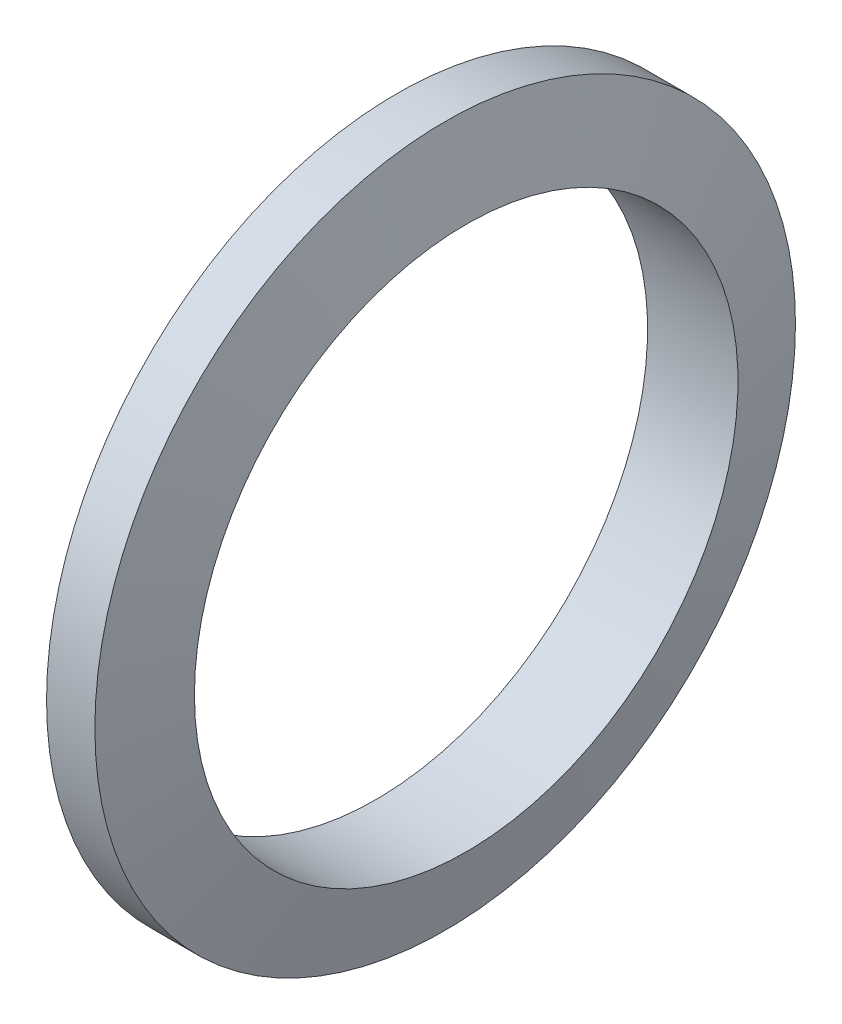
ISO-10303-21;
HEADER;
FILE_DESCRIPTION(('STEP AP214'),'2;1');
FILE_NAME('part.step','',(''),(''),'','','');
FILE_SCHEMA(('AUTOMOTIVE_DESIGN { 1 0 10303 214 1 1 1 1 }'));
ENDSEC;
DATA;
#1=APPLICATION_CONTEXT('core data for automotive mechanical design processes');
#2=APPLICATION_PROTOCOL_DEFINITION('international standard','automotive_design',2000,#1);
#3=PRODUCT_CONTEXT('',#1,'mechanical');
#4=PRODUCT('Part','Part','',(#3));
#5=PRODUCT_RELATED_PRODUCT_CATEGORY('part','',(#4));
#6=PRODUCT_DEFINITION_FORMATION('','',#4);
#7=PRODUCT_DEFINITION_CONTEXT('part definition',#1,'design');
#8=PRODUCT_DEFINITION('design','',#6,#7);
#9=PRODUCT_DEFINITION_SHAPE('','',#8);
#10=(LENGTH_UNIT() NAMED_UNIT(*) SI_UNIT(.MILLI.,.METRE.));
#11=(NAMED_UNIT(*) PLANE_ANGLE_UNIT() SI_UNIT($,.RADIAN.));
#12=(NAMED_UNIT(*) SI_UNIT($,.STERADIAN.) SOLID_ANGLE_UNIT());
#13=UNCERTAINTY_MEASURE_WITH_UNIT(LENGTH_MEASURE(1.E-05),#10,'distance_accuracy_value','');
#14=(GEOMETRIC_REPRESENTATION_CONTEXT(3) GLOBAL_UNCERTAINTY_ASSIGNED_CONTEXT((#13)) GLOBAL_UNIT_ASSIGNED_CONTEXT((#10,
#11,#12)) REPRESENTATION_CONTEXT('',''));
#15=CARTESIAN_POINT('',(0.,0.,0.));
#16=DIRECTION('',(0.,0.,1.));
#17=DIRECTION('',(1.,0.,0.));
#18=AXIS2_PLACEMENT_3D('',#15,#16,#17);
#19=CARTESIAN_POINT('',(-2.,0.,0.));
#20=DIRECTION('',(1.,0.,0.));
#21=DIRECTION('',(0.,0.,-1.));
#22=AXIS2_PLACEMENT_3D('',#19,#20,#21);
#23=CONICAL_SURFACE('',#22,29.,1.30899693899575);
#24=CARTESIAN_POINT('',(-3.74166975080231,0.,0.));
#25=DIRECTION('',(-1.,0.,0.));
#26=DIRECTION('',(0.,0.,1.));
#27=AXIS2_PLACEMENT_3D('',#24,#25,#26);
#28=CIRCLE('',#27,22.5);
#29=CARTESIAN_POINT('',(-3.74166975080231,0.,22.5));
#30=VERTEX_POINT('',#29);
#31=EDGE_CURVE('E10',#30,#30,#28,.T.);
#32=ORIENTED_EDGE('',*,*,#31,.F.);
#33=EDGE_LOOP('',(#32));
#34=FACE_BOUND('',#33,.T.);
#35=CARTESIAN_POINT('',(-2.,0.,0.));
#36=DIRECTION('',(-1.,0.,0.));
#37=DIRECTION('',(0.,0.,1.));
#38=AXIS2_PLACEMENT_3D('',#35,#36,#37);
#39=CIRCLE('',#38,29.);
#40=CARTESIAN_POINT('',(-2.,0.,29.));
#41=VERTEX_POINT('',#40);
#42=EDGE_CURVE('E44',#41,#41,#39,.T.);
#43=ORIENTED_EDGE('',*,*,#42,.T.);
#44=EDGE_LOOP('',(#43));
#45=FACE_BOUND('',#44,.T.);
#46=ADVANCED_FACE('F30',(#34,#45),#23,.T.);
#47=CARTESIAN_POINT('',(-10.,0.,0.));
#48=DIRECTION('',(-1.,0.,0.));
#49=DIRECTION('',(0.,0.,1.));
#50=AXIS2_PLACEMENT_3D('',#47,#48,#49);
#51=CYLINDRICAL_SURFACE('',#50,22.5);
#52=CARTESIAN_POINT('',(3.74166975080231,0.,0.));
#53=DIRECTION('',(-1.,0.,0.));
#54=DIRECTION('',(0.,0.,1.));
#55=AXIS2_PLACEMENT_3D('',#52,#53,#54);
#56=CIRCLE('',#55,22.5);
#57=CARTESIAN_POINT('',(3.74166975080231,0.,22.5));
#58=VERTEX_POINT('',#57);
#59=EDGE_CURVE('E36',#58,#58,#56,.T.);
#60=ORIENTED_EDGE('',*,*,#59,.F.);
#61=EDGE_LOOP('',(#60));
#62=FACE_BOUND('',#61,.T.);
#63=ORIENTED_EDGE('',*,*,#31,.T.);
#64=EDGE_LOOP('',(#63));
#65=FACE_BOUND('',#64,.T.);
#66=ADVANCED_FACE('F59',(#62,#65),#51,.F.);
#67=CARTESIAN_POINT('',(3.74166975080231,0.,0.));
#68=DIRECTION('',(-1.,0.,0.));
#69=DIRECTION('',(0.,0.,1.));
#70=AXIS2_PLACEMENT_3D('',#67,#68,#69);
#71=CONICAL_SURFACE('',#70,22.5,1.30899693899575);
#72=CARTESIAN_POINT('',(2.,0.,0.));
#73=DIRECTION('',(-1.,0.,0.));
#74=DIRECTION('',(0.,0.,1.));
#75=AXIS2_PLACEMENT_3D('',#72,#73,#74);
#76=CIRCLE('',#75,29.);
#77=CARTESIAN_POINT('',(2.,0.,29.));
#78=VERTEX_POINT('',#77);
#79=EDGE_CURVE('E40',#78,#78,#76,.T.);
#80=ORIENTED_EDGE('',*,*,#79,.F.);
#81=EDGE_LOOP('',(#80));
#82=FACE_BOUND('',#81,.T.);
#83=ORIENTED_EDGE('',*,*,#59,.T.);
#84=EDGE_LOOP('',(#83));
#85=FACE_BOUND('',#84,.T.);
#86=ADVANCED_FACE('F54',(#82,#85),#71,.T.);
#87=CARTESIAN_POINT('',(-10.,0.,0.));
#88=DIRECTION('',(-1.,0.,0.));
#89=DIRECTION('',(0.,0.,1.));
#90=AXIS2_PLACEMENT_3D('',#87,#88,#89);
#91=CYLINDRICAL_SURFACE('',#90,29.);
#92=ORIENTED_EDGE('',*,*,#42,.F.);
#93=EDGE_LOOP('',(#92));
#94=FACE_BOUND('',#93,.T.);
#95=ORIENTED_EDGE('',*,*,#79,.T.);
#96=EDGE_LOOP('',(#95));
#97=FACE_BOUND('',#96,.T.);
#98=ADVANCED_FACE('F51',(#94,#97),#91,.T.);
#99=CLOSED_SHELL('',(#46,#66,#86,#98));
#100=MANIFOLD_SOLID_BREP('B2',#99);
#101=ADVANCED_BREP_SHAPE_REPRESENTATION('',(#18,#100),#14);
#102=SHAPE_DEFINITION_REPRESENTATION(#9,#101);
ENDSEC;
END-ISO-10303-21;
